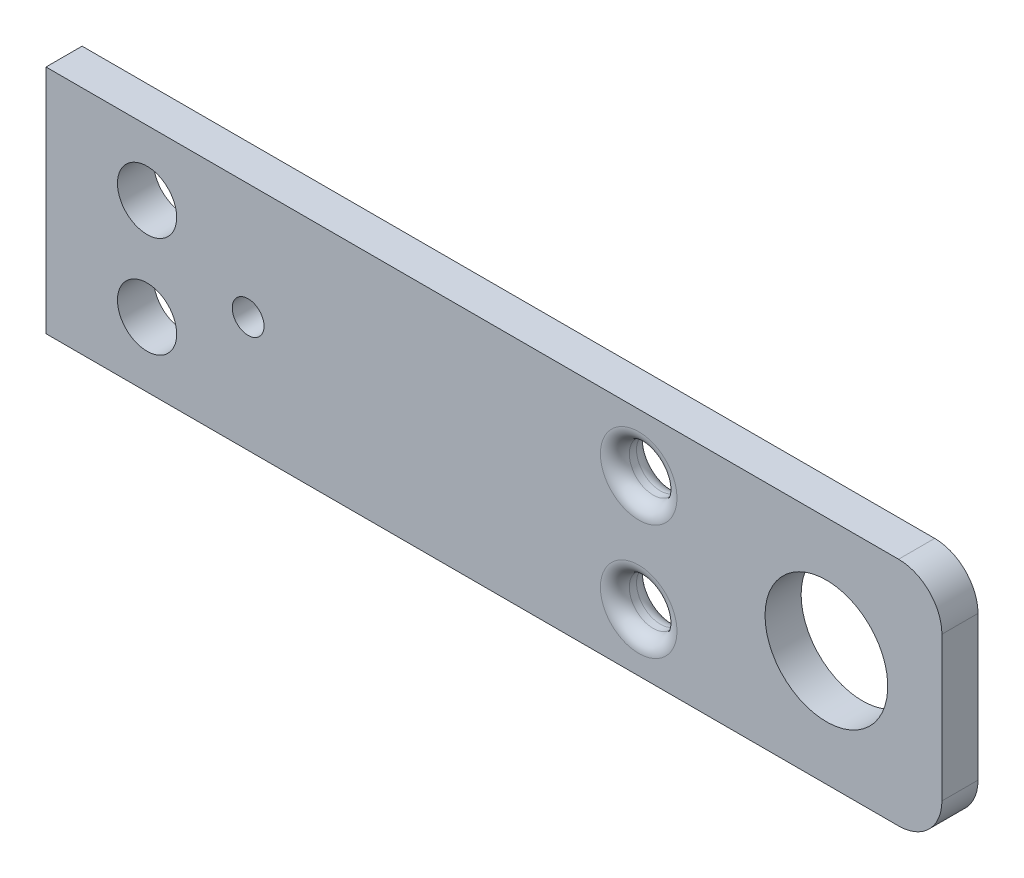
ISO-10303-21;
HEADER;
FILE_DESCRIPTION(('STEP AP214'),'2;1');
FILE_NAME('part.step','',(''),(''),'','','');
FILE_SCHEMA(('AUTOMOTIVE_DESIGN { 1 0 10303 214 1 1 1 1 }'));
ENDSEC;
DATA;
#1=APPLICATION_CONTEXT('core data for automotive mechanical design processes');
#2=APPLICATION_PROTOCOL_DEFINITION('international standard','automotive_design',2000,#1);
#3=PRODUCT_CONTEXT('',#1,'mechanical');
#4=PRODUCT('Part','Part','',(#3));
#5=PRODUCT_RELATED_PRODUCT_CATEGORY('part','',(#4));
#6=PRODUCT_DEFINITION_FORMATION('','',#4);
#7=PRODUCT_DEFINITION_CONTEXT('part definition',#1,'design');
#8=PRODUCT_DEFINITION('design','',#6,#7);
#9=PRODUCT_DEFINITION_SHAPE('','',#8);
#10=(LENGTH_UNIT() NAMED_UNIT(*) SI_UNIT(.MILLI.,.METRE.));
#11=(NAMED_UNIT(*) PLANE_ANGLE_UNIT() SI_UNIT($,.RADIAN.));
#12=(NAMED_UNIT(*) SI_UNIT($,.STERADIAN.) SOLID_ANGLE_UNIT());
#13=UNCERTAINTY_MEASURE_WITH_UNIT(LENGTH_MEASURE(1.E-05),#10,'distance_accuracy_value','');
#14=(GEOMETRIC_REPRESENTATION_CONTEXT(3) GLOBAL_UNCERTAINTY_ASSIGNED_CONTEXT((#13)) GLOBAL_UNIT_ASSIGNED_CONTEXT((#10,
#11,#12)) REPRESENTATION_CONTEXT('',''));
#15=CARTESIAN_POINT('',(0.,0.,0.));
#16=DIRECTION('',(0.,0.,1.));
#17=DIRECTION('',(1.,0.,0.));
#18=AXIS2_PLACEMENT_3D('',#15,#16,#17);
#19=CARTESIAN_POINT('',(-16.4594106635677,-5.06258735987649,0.));
#20=DIRECTION('',(-1.,0.,0.));
#21=DIRECTION('',(0.,0.,1.));
#22=AXIS2_PLACEMENT_3D('',#19,#20,#21);
#23=PLANE('',#22);
#24=DIRECTION('',(0.,1.,0.));
#25=VECTOR('',#24,1.);
#26=CARTESIAN_POINT('',(-16.4594106635677,-5.06258735987649,2.5));
#27=LINE('',#26,#25);
#28=CARTESIAN_POINT('',(-16.4594106635677,-5.06258735987649,2.5));
#29=VERTEX_POINT('',#28);
#30=CARTESIAN_POINT('',(-16.4594106635677,10.9374126401235,2.5));
#31=VERTEX_POINT('',#30);
#32=EDGE_CURVE('E95',#29,#31,#27,.T.);
#33=ORIENTED_EDGE('',*,*,#32,.T.);
#34=DIRECTION('',(0.,0.,1.));
#35=VECTOR('',#34,1.);
#36=CARTESIAN_POINT('',(-16.4594106635677,10.9374126401235,0.));
#37=LINE('',#36,#35);
#38=CARTESIAN_POINT('',(-16.4594106635677,10.9374126401235,0.));
#39=VERTEX_POINT('',#38);
#40=EDGE_CURVE('E90',#39,#31,#37,.T.);
#41=ORIENTED_EDGE('',*,*,#40,.F.);
#42=DIRECTION('',(0.,1.,0.));
#43=VECTOR('',#42,1.);
#44=CARTESIAN_POINT('',(-16.4594106635677,-5.06258735987649,0.));
#45=LINE('',#44,#43);
#46=CARTESIAN_POINT('',(-16.4594106635677,-5.06258735987649,0.));
#47=VERTEX_POINT('',#46);
#48=EDGE_CURVE('E93',#47,#39,#45,.T.);
#49=ORIENTED_EDGE('',*,*,#48,.F.);
#50=DIRECTION('',(0.,0.,1.));
#51=VECTOR('',#50,1.);
#52=CARTESIAN_POINT('',(-16.4594106635677,-5.06258735987649,0.));
#53=LINE('',#52,#51);
#54=EDGE_CURVE('E11',#47,#29,#53,.T.);
#55=ORIENTED_EDGE('',*,*,#54,.T.);
#56=EDGE_LOOP('',(#33,#41,#49,#55));
#57=FACE_BOUND('',#56,.T.);
#58=ADVANCED_FACE('F17',(#57),#23,.T.);
#59=CARTESIAN_POINT('',(42.5905893364316,-5.06258735987649,0.));
#60=DIRECTION('',(0.,-1.,0.));
#61=DIRECTION('',(0.,0.,-1.));
#62=AXIS2_PLACEMENT_3D('',#59,#60,#61);
#63=PLANE('',#62);
#64=DIRECTION('',(-1.,0.,0.));
#65=VECTOR('',#64,1.);
#66=CARTESIAN_POINT('',(42.5905893364316,-5.06258735987649,2.5));
#67=LINE('',#66,#65);
#68=CARTESIAN_POINT('',(42.5905893364316,-5.06258735987649,2.5));
#69=VERTEX_POINT('',#68);
#70=EDGE_CURVE('E169',#69,#29,#67,.T.);
#71=ORIENTED_EDGE('',*,*,#70,.T.);
#72=ORIENTED_EDGE('',*,*,#54,.F.);
#73=DIRECTION('',(-1.,0.,0.));
#74=VECTOR('',#73,1.);
#75=CARTESIAN_POINT('',(42.5905893364316,-5.06258735987649,0.));
#76=LINE('',#75,#74);
#77=CARTESIAN_POINT('',(42.5905893364316,-5.06258735987649,0.));
#78=VERTEX_POINT('',#77);
#79=EDGE_CURVE('E115',#78,#47,#76,.T.);
#80=ORIENTED_EDGE('',*,*,#79,.F.);
#81=DIRECTION('',(0.,0.,1.));
#82=VECTOR('',#81,1.);
#83=CARTESIAN_POINT('',(42.5905893364316,-5.06258735987649,0.));
#84=LINE('',#83,#82);
#85=EDGE_CURVE('E21',#78,#69,#84,.T.);
#86=ORIENTED_EDGE('',*,*,#85,.T.);
#87=EDGE_LOOP('',(#71,#72,#80,#86));
#88=FACE_BOUND('',#87,.T.);
#89=ADVANCED_FACE('F19',(#88),#63,.T.);
#90=CARTESIAN_POINT('',(42.5905893364316,-2.06258735987649,0.));
#91=DIRECTION('',(0.,0.,1.));
#92=DIRECTION('',(0.,1.,0.));
#93=AXIS2_PLACEMENT_3D('',#90,#91,#92);
#94=CYLINDRICAL_SURFACE('',#93,3.);
#95=CARTESIAN_POINT('',(42.5905893364316,-2.06258735987649,2.5));
#96=DIRECTION('',(0.,0.,-1.));
#97=DIRECTION('',(0.,1.,0.));
#98=AXIS2_PLACEMENT_3D('',#95,#96,#97);
#99=CIRCLE('',#98,3.);
#100=CARTESIAN_POINT('',(45.5905893364315,-2.06258735987649,2.5));
#101=VERTEX_POINT('',#100);
#102=EDGE_CURVE('E165',#101,#69,#99,.T.);
#103=ORIENTED_EDGE('',*,*,#102,.T.);
#104=ORIENTED_EDGE('',*,*,#85,.F.);
#105=CARTESIAN_POINT('',(42.5905893364316,-2.06258735987649,0.));
#106=DIRECTION('',(0.,0.,-1.));
#107=DIRECTION('',(0.,1.,0.));
#108=AXIS2_PLACEMENT_3D('',#105,#106,#107);
#109=CIRCLE('',#108,3.);
#110=CARTESIAN_POINT('',(45.5905893364315,-2.06258735987649,0.));
#111=VERTEX_POINT('',#110);
#112=EDGE_CURVE('E144',#111,#78,#109,.T.);
#113=ORIENTED_EDGE('',*,*,#112,.F.);
#114=DIRECTION('',(0.,0.,1.));
#115=VECTOR('',#114,1.);
#116=CARTESIAN_POINT('',(45.5905893364315,-2.06258735987649,0.));
#117=LINE('',#116,#115);
#118=EDGE_CURVE('E49',#111,#101,#117,.T.);
#119=ORIENTED_EDGE('',*,*,#118,.T.);
#120=EDGE_LOOP('',(#103,#104,#113,#119));
#121=FACE_BOUND('',#120,.T.);
#122=ADVANCED_FACE('F221',(#121),#94,.T.);
#123=CARTESIAN_POINT('',(45.5905893364315,7.93741264012351,0.));
#124=DIRECTION('',(1.,0.,0.));
#125=DIRECTION('',(0.,1.,0.));
#126=AXIS2_PLACEMENT_3D('',#123,#124,#125);
#127=PLANE('',#126);
#128=DIRECTION('',(0.,-1.,0.));
#129=VECTOR('',#128,1.);
#130=CARTESIAN_POINT('',(45.5905893364315,7.93741264012351,2.5));
#131=LINE('',#130,#129);
#132=CARTESIAN_POINT('',(45.5905893364315,7.93741264012351,2.5));
#133=VERTEX_POINT('',#132);
#134=EDGE_CURVE('E168',#133,#101,#131,.T.);
#135=ORIENTED_EDGE('',*,*,#134,.T.);
#136=ORIENTED_EDGE('',*,*,#118,.F.);
#137=DIRECTION('',(0.,-1.,0.));
#138=VECTOR('',#137,1.);
#139=CARTESIAN_POINT('',(45.5905893364315,7.93741264012351,0.));
#140=LINE('',#139,#138);
#141=CARTESIAN_POINT('',(45.5905893364315,7.93741264012351,0.));
#142=VERTEX_POINT('',#141);
#143=EDGE_CURVE('E141',#142,#111,#140,.T.);
#144=ORIENTED_EDGE('',*,*,#143,.F.);
#145=DIRECTION('',(0.,0.,1.));
#146=VECTOR('',#145,1.);
#147=CARTESIAN_POINT('',(45.5905893364315,7.93741264012351,0.));
#148=LINE('',#147,#146);
#149=EDGE_CURVE('E39',#142,#133,#148,.T.);
#150=ORIENTED_EDGE('',*,*,#149,.T.);
#151=EDGE_LOOP('',(#135,#136,#144,#150));
#152=FACE_BOUND('',#151,.T.);
#153=ADVANCED_FACE('F228',(#152),#127,.T.);
#154=CARTESIAN_POINT('',(42.5905893364316,7.93741264012351,0.));
#155=DIRECTION('',(0.,0.,1.));
#156=DIRECTION('',(-1.,0.,0.));
#157=AXIS2_PLACEMENT_3D('',#154,#155,#156);
#158=CYLINDRICAL_SURFACE('',#157,3.);
#159=CARTESIAN_POINT('',(42.5905893364316,7.93741264012351,2.5));
#160=DIRECTION('',(0.,0.,-1.));
#161=DIRECTION('',(-1.,0.,0.));
#162=AXIS2_PLACEMENT_3D('',#159,#160,#161);
#163=CIRCLE('',#162,3.);
#164=CARTESIAN_POINT('',(42.5905893364316,10.9374126401235,2.5));
#165=VERTEX_POINT('',#164);
#166=EDGE_CURVE('E193',#165,#133,#163,.T.);
#167=ORIENTED_EDGE('',*,*,#166,.T.);
#168=ORIENTED_EDGE('',*,*,#149,.F.);
#169=CARTESIAN_POINT('',(42.5905893364316,7.93741264012351,0.));
#170=DIRECTION('',(0.,0.,-1.));
#171=DIRECTION('',(-1.,0.,0.));
#172=AXIS2_PLACEMENT_3D('',#169,#170,#171);
#173=CIRCLE('',#172,3.);
#174=CARTESIAN_POINT('',(42.5905893364316,10.9374126401235,0.));
#175=VERTEX_POINT('',#174);
#176=EDGE_CURVE('E109',#175,#142,#173,.T.);
#177=ORIENTED_EDGE('',*,*,#176,.F.);
#178=DIRECTION('',(0.,0.,1.));
#179=VECTOR('',#178,1.);
#180=CARTESIAN_POINT('',(42.5905893364316,10.9374126401235,0.));
#181=LINE('',#180,#179);
#182=EDGE_CURVE('E100',#175,#165,#181,.T.);
#183=ORIENTED_EDGE('',*,*,#182,.T.);
#184=EDGE_LOOP('',(#167,#168,#177,#183));
#185=FACE_BOUND('',#184,.T.);
#186=ADVANCED_FACE('F227',(#185),#158,.T.);
#187=CARTESIAN_POINT('',(-16.4594106635677,10.9374126401235,0.));
#188=DIRECTION('',(0.,1.,0.));
#189=DIRECTION('',(1.,0.,0.));
#190=AXIS2_PLACEMENT_3D('',#187,#188,#189);
#191=PLANE('',#190);
#192=DIRECTION('',(1.,0.,0.));
#193=VECTOR('',#192,1.);
#194=CARTESIAN_POINT('',(-16.4594106635677,10.9374126401235,2.5));
#195=LINE('',#194,#193);
#196=EDGE_CURVE('E181',#31,#165,#195,.T.);
#197=ORIENTED_EDGE('',*,*,#196,.T.);
#198=ORIENTED_EDGE('',*,*,#182,.F.);
#199=DIRECTION('',(1.,0.,0.));
#200=VECTOR('',#199,1.);
#201=CARTESIAN_POINT('',(-16.4594106635677,10.9374126401235,0.));
#202=LINE('',#201,#200);
#203=EDGE_CURVE('E103',#39,#175,#202,.T.);
#204=ORIENTED_EDGE('',*,*,#203,.F.);
#205=ORIENTED_EDGE('',*,*,#40,.T.);
#206=EDGE_LOOP('',(#197,#198,#204,#205));
#207=FACE_BOUND('',#206,.T.);
#208=ADVANCED_FACE('F104',(#207),#191,.T.);
#209=CARTESIAN_POINT('',(-2.45941066356772,2.93741264012351,0.));
#210=DIRECTION('',(0.,0.,1.));
#211=DIRECTION('',(-1.,0.,0.));
#212=AXIS2_PLACEMENT_3D('',#209,#210,#211);
#213=CYLINDRICAL_SURFACE('',#212,1.1);
#214=CARTESIAN_POINT('',(-2.45941066356772,2.93741264012351,0.));
#215=DIRECTION('',(0.,0.,1.));
#216=DIRECTION('',(-1.,0.,0.));
#217=AXIS2_PLACEMENT_3D('',#214,#215,#216);
#218=CIRCLE('',#217,1.1);
#219=CARTESIAN_POINT('',(-3.55941066356772,2.93741264012351,0.));
#220=VERTEX_POINT('',#219);
#221=EDGE_CURVE('E149',#220,#220,#218,.T.);
#222=ORIENTED_EDGE('',*,*,#221,.F.);
#223=EDGE_LOOP('',(#222));
#224=FACE_BOUND('',#223,.T.);
#225=CARTESIAN_POINT('',(-2.45941066356772,2.93741264012351,2.5));
#226=DIRECTION('',(0.,0.,-1.));
#227=DIRECTION('',(-1.,0.,0.));
#228=AXIS2_PLACEMENT_3D('',#225,#226,#227);
#229=CIRCLE('',#228,1.1);
#230=CARTESIAN_POINT('',(-3.55941066356772,2.93741264012351,2.5));
#231=VERTEX_POINT('',#230);
#232=EDGE_CURVE('E137',#231,#231,#229,.T.);
#233=ORIENTED_EDGE('',*,*,#232,.F.);
#234=EDGE_LOOP('',(#233));
#235=FACE_BOUND('',#234,.T.);
#236=ADVANCED_FACE('F294',(#224,#235),#213,.F.);
#237=CARTESIAN_POINT('',(-9.45941066356772,6.43741264012351,0.));
#238=DIRECTION('',(0.,0.,1.));
#239=DIRECTION('',(-1.,0.,0.));
#240=AXIS2_PLACEMENT_3D('',#237,#238,#239);
#241=CYLINDRICAL_SURFACE('',#240,2.05);
#242=CARTESIAN_POINT('',(-9.45941066356772,6.43741264012351,0.));
#243=DIRECTION('',(0.,0.,1.));
#244=DIRECTION('',(-1.,0.,0.));
#245=AXIS2_PLACEMENT_3D('',#242,#243,#244);
#246=CIRCLE('',#245,2.05);
#247=CARTESIAN_POINT('',(-11.5094106635677,6.43741264012351,0.));
#248=VERTEX_POINT('',#247);
#249=EDGE_CURVE('E145',#248,#248,#246,.T.);
#250=ORIENTED_EDGE('',*,*,#249,.F.);
#251=EDGE_LOOP('',(#250));
#252=FACE_BOUND('',#251,.T.);
#253=CARTESIAN_POINT('',(-9.45941066356772,6.43741264012351,2.5));
#254=DIRECTION('',(0.,0.,-1.));
#255=DIRECTION('',(-1.,0.,0.));
#256=AXIS2_PLACEMENT_3D('',#253,#254,#255);
#257=CIRCLE('',#256,2.05);
#258=CARTESIAN_POINT('',(-11.5094106635677,6.43741264012351,2.5));
#259=VERTEX_POINT('',#258);
#260=EDGE_CURVE('E208',#259,#259,#257,.T.);
#261=ORIENTED_EDGE('',*,*,#260,.F.);
#262=EDGE_LOOP('',(#261));
#263=FACE_BOUND('',#262,.T.);
#264=ADVANCED_FACE('F264',(#252,#263),#241,.F.);
#265=CARTESIAN_POINT('',(-9.45941066356772,-0.562587359876488,0.));
#266=DIRECTION('',(0.,0.,1.));
#267=DIRECTION('',(-1.,0.,0.));
#268=AXIS2_PLACEMENT_3D('',#265,#266,#267);
#269=CYLINDRICAL_SURFACE('',#268,2.05);
#270=CARTESIAN_POINT('',(-9.45941066356772,-0.562587359876488,0.));
#271=DIRECTION('',(0.,0.,1.));
#272=DIRECTION('',(-1.,0.,0.));
#273=AXIS2_PLACEMENT_3D('',#270,#271,#272);
#274=CIRCLE('',#273,2.05);
#275=CARTESIAN_POINT('',(-11.5094106635677,-0.562587359876488,0.));
#276=VERTEX_POINT('',#275);
#277=EDGE_CURVE('E134',#276,#276,#274,.T.);
#278=ORIENTED_EDGE('',*,*,#277,.F.);
#279=EDGE_LOOP('',(#278));
#280=FACE_BOUND('',#279,.T.);
#281=CARTESIAN_POINT('',(-9.45941066356772,-0.562587359876488,2.5));
#282=DIRECTION('',(0.,0.,-1.));
#283=DIRECTION('',(-1.,0.,0.));
#284=AXIS2_PLACEMENT_3D('',#281,#282,#283);
#285=CIRCLE('',#284,2.05);
#286=CARTESIAN_POINT('',(-11.5094106635677,-0.562587359876488,2.5));
#287=VERTEX_POINT('',#286);
#288=EDGE_CURVE('E204',#287,#287,#285,.T.);
#289=ORIENTED_EDGE('',*,*,#288,.F.);
#290=EDGE_LOOP('',(#289));
#291=FACE_BOUND('',#290,.T.);
#292=ADVANCED_FACE('F258',(#280,#291),#269,.F.);
#293=CARTESIAN_POINT('',(37.5905893364315,2.93741264012351,0.));
#294=DIRECTION('',(0.,0.,1.));
#295=DIRECTION('',(-1.,0.,0.));
#296=AXIS2_PLACEMENT_3D('',#293,#294,#295);
#297=CYLINDRICAL_SURFACE('',#296,4.25);
#298=CARTESIAN_POINT('',(37.5905893364315,2.93741264012351,0.));
#299=DIRECTION('',(0.,0.,1.));
#300=DIRECTION('',(-1.,0.,0.));
#301=AXIS2_PLACEMENT_3D('',#298,#299,#300);
#302=CIRCLE('',#301,4.25);
#303=CARTESIAN_POINT('',(33.3405893364316,2.93741264012351,0.));
#304=VERTEX_POINT('',#303);
#305=EDGE_CURVE('E130',#304,#304,#302,.T.);
#306=ORIENTED_EDGE('',*,*,#305,.F.);
#307=EDGE_LOOP('',(#306));
#308=FACE_BOUND('',#307,.T.);
#309=CARTESIAN_POINT('',(37.5905893364315,2.93741264012351,2.5));
#310=DIRECTION('',(0.,0.,-1.));
#311=DIRECTION('',(-1.,0.,0.));
#312=AXIS2_PLACEMENT_3D('',#309,#310,#311);
#313=CIRCLE('',#312,4.25);
#314=CARTESIAN_POINT('',(33.3405893364316,2.93741264012351,2.5));
#315=VERTEX_POINT('',#314);
#316=EDGE_CURVE('E200',#315,#315,#313,.T.);
#317=ORIENTED_EDGE('',*,*,#316,.F.);
#318=EDGE_LOOP('',(#317));
#319=FACE_BOUND('',#318,.T.);
#320=ADVANCED_FACE('F254',(#308,#319),#297,.F.);
#321=CARTESIAN_POINT('',(24.5905893364315,6.93741264012351,1.5));
#322=DIRECTION('',(0.,0.,-1.));
#323=DIRECTION('',(-1.,0.,0.));
#324=AXIS2_PLACEMENT_3D('',#321,#322,#323);
#325=TOROIDAL_SURFACE('',#324,2.65,1.);
#326=CARTESIAN_POINT('',(24.5905893364315,6.93741264012351,2.5));
#327=DIRECTION('',(0.,0.,1.));
#328=DIRECTION('',(-1.,0.,0.));
#329=AXIS2_PLACEMENT_3D('',#326,#327,#328);
#330=CIRCLE('',#329,2.65);
#331=CARTESIAN_POINT('',(21.9405893364316,6.93741264012351,2.5));
#332=VERTEX_POINT('',#331);
#333=EDGE_CURVE('E196',#332,#332,#330,.T.);
#334=ORIENTED_EDGE('',*,*,#333,.T.);
#335=EDGE_LOOP('',(#334));
#336=FACE_BOUND('',#335,.T.);
#337=CARTESIAN_POINT('',(24.5905893364315,6.93741264012351,1.5));
#338=DIRECTION('',(0.,0.,-1.));
#339=DIRECTION('',(-1.,0.,0.));
#340=AXIS2_PLACEMENT_3D('',#337,#338,#339);
#341=CIRCLE('',#340,1.65);
#342=CARTESIAN_POINT('',(22.9405893364316,6.93741264012351,1.5));
#343=VERTEX_POINT('',#342);
#344=EDGE_CURVE('E173',#343,#343,#341,.T.);
#345=ORIENTED_EDGE('',*,*,#344,.T.);
#346=EDGE_LOOP('',(#345));
#347=FACE_BOUND('',#346,.T.);
#348=ADVANCED_FACE('F257',(#336,#347),#325,.T.);
#349=CARTESIAN_POINT('',(14.0343693887614,2.93741264012351,2.5));
#350=DIRECTION('',(0.,0.,1.));
#351=DIRECTION('',(1.,0.,0.));
#352=AXIS2_PLACEMENT_3D('',#349,#350,#351);
#353=PLANE('',#352);
#354=CARTESIAN_POINT('',(24.5905893364315,-1.06258735987649,2.5));
#355=DIRECTION('',(0.,0.,1.));
#356=DIRECTION('',(-1.,0.,0.));
#357=AXIS2_PLACEMENT_3D('',#354,#355,#356);
#358=CIRCLE('',#357,2.65);
#359=CARTESIAN_POINT('',(21.9405893364316,-1.06258735987649,2.5));
#360=VERTEX_POINT('',#359);
#361=EDGE_CURVE('E177',#360,#360,#358,.T.);
#362=ORIENTED_EDGE('',*,*,#361,.F.);
#363=EDGE_LOOP('',(#362));
#364=FACE_BOUND('',#363,.T.);
#365=ORIENTED_EDGE('',*,*,#232,.T.);
#366=EDGE_LOOP('',(#365));
#367=FACE_BOUND('',#366,.T.);
#368=ORIENTED_EDGE('',*,*,#260,.T.);
#369=EDGE_LOOP('',(#368));
#370=FACE_BOUND('',#369,.T.);
#371=ORIENTED_EDGE('',*,*,#288,.T.);
#372=EDGE_LOOP('',(#371));
#373=FACE_BOUND('',#372,.T.);
#374=ORIENTED_EDGE('',*,*,#316,.T.);
#375=EDGE_LOOP('',(#374));
#376=FACE_BOUND('',#375,.T.);
#377=ORIENTED_EDGE('',*,*,#333,.F.);
#378=EDGE_LOOP('',(#377));
#379=FACE_BOUND('',#378,.T.);
#380=ORIENTED_EDGE('',*,*,#196,.F.);
#381=ORIENTED_EDGE('',*,*,#32,.F.);
#382=ORIENTED_EDGE('',*,*,#70,.F.);
#383=ORIENTED_EDGE('',*,*,#102,.F.);
#384=ORIENTED_EDGE('',*,*,#134,.F.);
#385=ORIENTED_EDGE('',*,*,#166,.F.);
#386=EDGE_LOOP('',(#380,#381,#382,#383,#384,#385));
#387=FACE_BOUND('',#386,.T.);
#388=ADVANCED_FACE('F224',(#364,#367,#370,#373,#376,#379,#387),#353,.T.);
#389=CARTESIAN_POINT('',(24.5905893364315,-1.06258735987649,1.5));
#390=DIRECTION('',(0.,0.,-1.));
#391=DIRECTION('',(-1.,0.,0.));
#392=AXIS2_PLACEMENT_3D('',#389,#390,#391);
#393=TOROIDAL_SURFACE('',#392,2.65,1.);
#394=ORIENTED_EDGE('',*,*,#361,.T.);
#395=EDGE_LOOP('',(#394));
#396=FACE_BOUND('',#395,.T.);
#397=CARTESIAN_POINT('',(24.5905893364315,-1.06258735987649,1.5));
#398=DIRECTION('',(0.,0.,-1.));
#399=DIRECTION('',(-1.,0.,0.));
#400=AXIS2_PLACEMENT_3D('',#397,#398,#399);
#401=CIRCLE('',#400,1.65);
#402=CARTESIAN_POINT('',(22.9405893364316,-1.06258735987649,1.5));
#403=VERTEX_POINT('',#402);
#404=EDGE_CURVE('E163',#403,#403,#401,.T.);
#405=ORIENTED_EDGE('',*,*,#404,.T.);
#406=EDGE_LOOP('',(#405));
#407=FACE_BOUND('',#406,.T.);
#408=ADVANCED_FACE('F252',(#396,#407),#393,.T.);
#409=CARTESIAN_POINT('',(24.5905893364315,6.93741264012351,0.));
#410=DIRECTION('',(0.,0.,1.));
#411=DIRECTION('',(-1.,0.,0.));
#412=AXIS2_PLACEMENT_3D('',#409,#410,#411);
#413=CYLINDRICAL_SURFACE('',#412,1.65);
#414=CARTESIAN_POINT('',(24.5905893364315,6.93741264012351,1.));
#415=DIRECTION('',(0.,0.,1.));
#416=DIRECTION('',(1.,0.,0.));
#417=AXIS2_PLACEMENT_3D('',#414,#415,#416);
#418=CIRCLE('',#417,1.65);
#419=CARTESIAN_POINT('',(26.2405893364315,6.93741264012351,1.));
#420=VERTEX_POINT('',#419);
#421=EDGE_CURVE('E128',#420,#420,#418,.T.);
#422=ORIENTED_EDGE('',*,*,#421,.F.);
#423=EDGE_LOOP('',(#422));
#424=FACE_BOUND('',#423,.T.);
#425=ORIENTED_EDGE('',*,*,#344,.F.);
#426=EDGE_LOOP('',(#425));
#427=FACE_BOUND('',#426,.T.);
#428=ADVANCED_FACE('F249',(#424,#427),#413,.F.);
#429=CARTESIAN_POINT('',(24.5905893364315,6.93741264012351,1.));
#430=DIRECTION('',(0.,0.,1.));
#431=DIRECTION('',(1.,0.,0.));
#432=AXIS2_PLACEMENT_3D('',#429,#430,#431);
#433=TOROIDAL_SURFACE('',#432,2.65,1.);
#434=CARTESIAN_POINT('',(24.5905893364315,6.93741264012351,0.));
#435=DIRECTION('',(0.,0.,-1.));
#436=DIRECTION('',(1.,0.,0.));
#437=AXIS2_PLACEMENT_3D('',#434,#435,#436);
#438=CIRCLE('',#437,2.65);
#439=CARTESIAN_POINT('',(27.2405893364315,6.93741264012351,0.));
#440=VERTEX_POINT('',#439);
#441=EDGE_CURVE('E135',#440,#440,#438,.T.);
#442=ORIENTED_EDGE('',*,*,#441,.T.);
#443=EDGE_LOOP('',(#442));
#444=FACE_BOUND('',#443,.T.);
#445=ORIENTED_EDGE('',*,*,#421,.T.);
#446=EDGE_LOOP('',(#445));
#447=FACE_BOUND('',#446,.T.);
#448=ADVANCED_FACE('F247',(#444,#447),#433,.T.);
#449=CARTESIAN_POINT('',(24.5905893364315,-1.06258735987649,0.));
#450=DIRECTION('',(0.,0.,1.));
#451=DIRECTION('',(-1.,0.,0.));
#452=AXIS2_PLACEMENT_3D('',#449,#450,#451);
#453=CYLINDRICAL_SURFACE('',#452,1.65);
#454=CARTESIAN_POINT('',(24.5905893364315,-1.06258735987649,1.));
#455=DIRECTION('',(0.,0.,1.));
#456=DIRECTION('',(-1.,0.,0.));
#457=AXIS2_PLACEMENT_3D('',#454,#455,#456);
#458=CIRCLE('',#457,1.65);
#459=CARTESIAN_POINT('',(22.9405893364316,-1.06258735987649,1.));
#460=VERTEX_POINT('',#459);
#461=EDGE_CURVE('E124',#460,#460,#458,.T.);
#462=ORIENTED_EDGE('',*,*,#461,.F.);
#463=EDGE_LOOP('',(#462));
#464=FACE_BOUND('',#463,.T.);
#465=ORIENTED_EDGE('',*,*,#404,.F.);
#466=EDGE_LOOP('',(#465));
#467=FACE_BOUND('',#466,.T.);
#468=ADVANCED_FACE('F403',(#464,#467),#453,.F.);
#469=CARTESIAN_POINT('',(14.0343693887614,2.93741264012351,0.));
#470=DIRECTION('',(0.,0.,1.));
#471=DIRECTION('',(1.,0.,0.));
#472=AXIS2_PLACEMENT_3D('',#469,#470,#471);
#473=PLANE('',#472);
#474=CARTESIAN_POINT('',(24.5905893364315,-1.06258735987649,0.));
#475=DIRECTION('',(0.,0.,-1.));
#476=DIRECTION('',(-1.,0.,0.));
#477=AXIS2_PLACEMENT_3D('',#474,#475,#476);
#478=CIRCLE('',#477,2.65);
#479=CARTESIAN_POINT('',(21.9405893364316,-1.06258735987649,0.));
#480=VERTEX_POINT('',#479);
#481=EDGE_CURVE('E117',#480,#480,#478,.T.);
#482=ORIENTED_EDGE('',*,*,#481,.F.);
#483=EDGE_LOOP('',(#482));
#484=FACE_BOUND('',#483,.T.);
#485=ORIENTED_EDGE('',*,*,#221,.T.);
#486=EDGE_LOOP('',(#485));
#487=FACE_BOUND('',#486,.T.);
#488=ORIENTED_EDGE('',*,*,#249,.T.);
#489=EDGE_LOOP('',(#488));
#490=FACE_BOUND('',#489,.T.);
#491=ORIENTED_EDGE('',*,*,#277,.T.);
#492=EDGE_LOOP('',(#491));
#493=FACE_BOUND('',#492,.T.);
#494=ORIENTED_EDGE('',*,*,#305,.T.);
#495=EDGE_LOOP('',(#494));
#496=FACE_BOUND('',#495,.T.);
#497=ORIENTED_EDGE('',*,*,#441,.F.);
#498=EDGE_LOOP('',(#497));
#499=FACE_BOUND('',#498,.T.);
#500=ORIENTED_EDGE('',*,*,#48,.T.);
#501=ORIENTED_EDGE('',*,*,#203,.T.);
#502=ORIENTED_EDGE('',*,*,#176,.T.);
#503=ORIENTED_EDGE('',*,*,#143,.T.);
#504=ORIENTED_EDGE('',*,*,#112,.T.);
#505=ORIENTED_EDGE('',*,*,#79,.T.);
#506=EDGE_LOOP('',(#500,#501,#502,#503,#504,#505));
#507=FACE_BOUND('',#506,.T.);
#508=ADVANCED_FACE('F112',(#484,#487,#490,#493,#496,#499,#507),#473,.F.);
#509=CARTESIAN_POINT('',(24.5905893364315,-1.06258735987649,1.));
#510=DIRECTION('',(0.,0.,1.));
#511=DIRECTION('',(1.,0.,0.));
#512=AXIS2_PLACEMENT_3D('',#509,#510,#511);
#513=TOROIDAL_SURFACE('',#512,2.65,1.);
#514=ORIENTED_EDGE('',*,*,#481,.T.);
#515=EDGE_LOOP('',(#514));
#516=FACE_BOUND('',#515,.T.);
#517=ORIENTED_EDGE('',*,*,#461,.T.);
#518=EDGE_LOOP('',(#517));
#519=FACE_BOUND('',#518,.T.);
#520=ADVANCED_FACE('F422',(#516,#519),#513,.T.);
#521=CLOSED_SHELL('',(#58,#89,#122,#153,#186,#208,#236,#264,#292,#320,#348,#388,#408,#428,#448,
#468,#508,#520));
#522=MANIFOLD_SOLID_BREP('B1',#521);
#523=ADVANCED_BREP_SHAPE_REPRESENTATION('',(#18,#522),#14);
#524=SHAPE_DEFINITION_REPRESENTATION(#9,#523);
ENDSEC;
END-ISO-10303-21;
